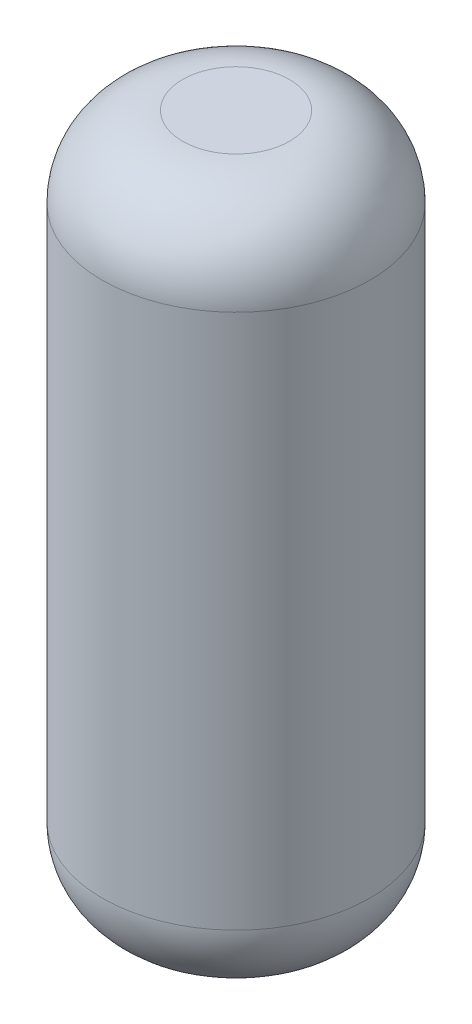
ISO-10303-21;
HEADER;
FILE_DESCRIPTION(('STEP AP214'),'2;1');
FILE_NAME('part.step','',(''),(''),'','','');
FILE_SCHEMA(('AUTOMOTIVE_DESIGN { 1 0 10303 214 1 1 1 1 }'));
ENDSEC;
DATA;
#1=APPLICATION_CONTEXT('core data for automotive mechanical design processes');
#2=APPLICATION_PROTOCOL_DEFINITION('international standard','automotive_design',2000,#1);
#3=PRODUCT_CONTEXT('',#1,'mechanical');
#4=PRODUCT('Part','Part','',(#3));
#5=PRODUCT_RELATED_PRODUCT_CATEGORY('part','',(#4));
#6=PRODUCT_DEFINITION_FORMATION('','',#4);
#7=PRODUCT_DEFINITION_CONTEXT('part definition',#1,'design');
#8=PRODUCT_DEFINITION('design','',#6,#7);
#9=PRODUCT_DEFINITION_SHAPE('','',#8);
#10=(LENGTH_UNIT() NAMED_UNIT(*) SI_UNIT(.MILLI.,.METRE.));
#11=(NAMED_UNIT(*) PLANE_ANGLE_UNIT() SI_UNIT($,.RADIAN.));
#12=(NAMED_UNIT(*) SI_UNIT($,.STERADIAN.) SOLID_ANGLE_UNIT());
#13=UNCERTAINTY_MEASURE_WITH_UNIT(LENGTH_MEASURE(1.E-05),#10,'distance_accuracy_value','');
#14=(GEOMETRIC_REPRESENTATION_CONTEXT(3) GLOBAL_UNCERTAINTY_ASSIGNED_CONTEXT((#13)) GLOBAL_UNIT_ASSIGNED_CONTEXT((#10,
#11,#12)) REPRESENTATION_CONTEXT('',''));
#15=CARTESIAN_POINT('',(0.,0.,0.));
#16=DIRECTION('',(0.,0.,1.));
#17=DIRECTION('',(1.,0.,0.));
#18=AXIS2_PLACEMENT_3D('',#15,#16,#17);
#19=CARTESIAN_POINT('',(0.,26.,0.));
#20=DIRECTION('',(0.,-1.,0.));
#21=DIRECTION('',(0.,0.,-1.));
#22=AXIS2_PLACEMENT_3D('',#19,#20,#21);
#23=CYLINDRICAL_SURFACE('',#22,5.);
#24=CARTESIAN_POINT('',(0.,2.99999999999999,0.));
#25=DIRECTION('',(0.,1.,0.));
#26=DIRECTION('',(0.,0.,1.));
#27=AXIS2_PLACEMENT_3D('',#24,#25,#26);
#28=CIRCLE('',#27,5.);
#29=CARTESIAN_POINT('',(0.,2.99999999999999,5.));
#30=VERTEX_POINT('',#29);
#31=EDGE_CURVE('E42',#30,#30,#28,.T.);
#32=ORIENTED_EDGE('',*,*,#31,.T.);
#33=EDGE_LOOP('',(#32));
#34=FACE_BOUND('',#33,.T.);
#35=CARTESIAN_POINT('',(0.,23.,0.));
#36=DIRECTION('',(0.,1.,0.));
#37=DIRECTION('',(0.,0.,1.));
#38=AXIS2_PLACEMENT_3D('',#35,#36,#37);
#39=CIRCLE('',#38,5.);
#40=CARTESIAN_POINT('',(0.,23.,5.));
#41=VERTEX_POINT('',#40);
#42=EDGE_CURVE('E46',#41,#41,#39,.F.);
#43=ORIENTED_EDGE('',*,*,#42,.T.);
#44=EDGE_LOOP('',(#43));
#45=FACE_BOUND('',#44,.T.);
#46=ADVANCED_FACE('F31',(#34,#45),#23,.T.);
#47=CARTESIAN_POINT('',(0.,26.,0.));
#48=DIRECTION('',(0.,1.,0.));
#49=DIRECTION('',(0.,0.,1.));
#50=AXIS2_PLACEMENT_3D('',#47,#48,#49);
#51=PLANE('',#50);
#52=CARTESIAN_POINT('',(0.,26.,0.));
#53=DIRECTION('',(0.,1.,0.));
#54=DIRECTION('',(0.,0.,1.));
#55=AXIS2_PLACEMENT_3D('',#52,#53,#54);
#56=CIRCLE('',#55,2.);
#57=CARTESIAN_POINT('',(0.,26.,2.));
#58=VERTEX_POINT('',#57);
#59=EDGE_CURVE('E10',#58,#58,#56,.T.);
#60=ORIENTED_EDGE('',*,*,#59,.T.);
#61=EDGE_LOOP('',(#60));
#62=FACE_BOUND('',#61,.T.);
#63=ADVANCED_FACE('F62',(#62),#51,.T.);
#64=CARTESIAN_POINT('',(0.,0.,0.));
#65=DIRECTION('',(0.,1.,0.));
#66=DIRECTION('',(0.,0.,1.));
#67=AXIS2_PLACEMENT_3D('',#64,#65,#66);
#68=PLANE('',#67);
#69=CARTESIAN_POINT('',(0.,0.,0.));
#70=DIRECTION('',(0.,1.,0.));
#71=DIRECTION('',(0.,0.,1.));
#72=AXIS2_PLACEMENT_3D('',#69,#70,#71);
#73=CIRCLE('',#72,2.);
#74=CARTESIAN_POINT('',(0.,0.,2.));
#75=VERTEX_POINT('',#74);
#76=EDGE_CURVE('E38',#75,#75,#73,.F.);
#77=ORIENTED_EDGE('',*,*,#76,.T.);
#78=EDGE_LOOP('',(#77));
#79=FACE_BOUND('',#78,.T.);
#80=ADVANCED_FACE('F59',(#79),#68,.F.);
#81=CARTESIAN_POINT('',(0.,3.,0.));
#82=DIRECTION('',(0.,1.,0.));
#83=DIRECTION('',(0.,0.,1.));
#84=AXIS2_PLACEMENT_3D('',#81,#82,#83);
#85=DEGENERATE_TOROIDAL_SURFACE('',#84,2.,3.,.T.);
#86=ORIENTED_EDGE('',*,*,#76,.F.);
#87=EDGE_LOOP('',(#86));
#88=FACE_BOUND('',#87,.T.);
#89=ORIENTED_EDGE('',*,*,#31,.F.);
#90=EDGE_LOOP('',(#89));
#91=FACE_BOUND('',#90,.T.);
#92=ADVANCED_FACE('F55',(#88,#91),#85,.T.);
#93=CARTESIAN_POINT('',(0.,23.,0.));
#94=DIRECTION('',(0.,1.,0.));
#95=DIRECTION('',(0.,0.,1.));
#96=AXIS2_PLACEMENT_3D('',#93,#94,#95);
#97=DEGENERATE_TOROIDAL_SURFACE('',#96,2.,3.,.T.);
#98=ORIENTED_EDGE('',*,*,#42,.F.);
#99=EDGE_LOOP('',(#98));
#100=FACE_BOUND('',#99,.T.);
#101=ORIENTED_EDGE('',*,*,#59,.F.);
#102=EDGE_LOOP('',(#101));
#103=FACE_BOUND('',#102,.T.);
#104=ADVANCED_FACE('F33',(#100,#103),#97,.T.);
#105=CLOSED_SHELL('',(#46,#63,#80,#92,#104));
#106=MANIFOLD_SOLID_BREP('B2',#105);
#107=ADVANCED_BREP_SHAPE_REPRESENTATION('',(#18,#106),#14);
#108=SHAPE_DEFINITION_REPRESENTATION(#9,#107);
ENDSEC;
END-ISO-10303-21;
